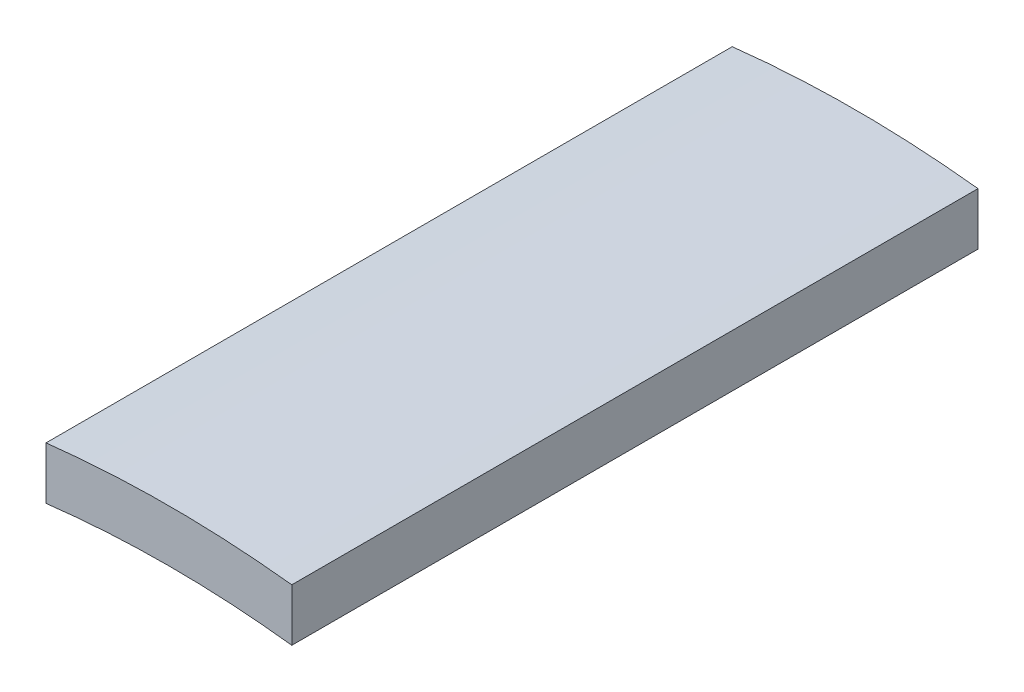
ISO-10303-21;
HEADER;
FILE_DESCRIPTION(('STEP AP214'),'2;1');
FILE_NAME('part.step','',(''),(''),'','','');
FILE_SCHEMA(('AUTOMOTIVE_DESIGN { 1 0 10303 214 1 1 1 1 }'));
ENDSEC;
DATA;
#1=APPLICATION_CONTEXT('core data for automotive mechanical design processes');
#2=APPLICATION_PROTOCOL_DEFINITION('international standard','automotive_design',2000,#1);
#3=PRODUCT_CONTEXT('',#1,'mechanical');
#4=PRODUCT('Part','Part','',(#3));
#5=PRODUCT_RELATED_PRODUCT_CATEGORY('part','',(#4));
#6=PRODUCT_DEFINITION_FORMATION('','',#4);
#7=PRODUCT_DEFINITION_CONTEXT('part definition',#1,'design');
#8=PRODUCT_DEFINITION('design','',#6,#7);
#9=PRODUCT_DEFINITION_SHAPE('','',#8);
#10=(LENGTH_UNIT() NAMED_UNIT(*) SI_UNIT(.MILLI.,.METRE.));
#11=(NAMED_UNIT(*) PLANE_ANGLE_UNIT() SI_UNIT($,.RADIAN.));
#12=(NAMED_UNIT(*) SI_UNIT($,.STERADIAN.) SOLID_ANGLE_UNIT());
#13=UNCERTAINTY_MEASURE_WITH_UNIT(LENGTH_MEASURE(1.E-05),#10,'distance_accuracy_value','');
#14=(GEOMETRIC_REPRESENTATION_CONTEXT(3) GLOBAL_UNCERTAINTY_ASSIGNED_CONTEXT((#13)) GLOBAL_UNIT_ASSIGNED_CONTEXT((#10,
#11,#12)) REPRESENTATION_CONTEXT('',''));
#15=CARTESIAN_POINT('',(0.,0.,0.));
#16=DIRECTION('',(0.,0.,1.));
#17=DIRECTION('',(1.,0.,0.));
#18=AXIS2_PLACEMENT_3D('',#15,#16,#17);
#19=CARTESIAN_POINT('',(-110.435261655171,-75.8999546142995,6.56206354763538));
#20=DIRECTION('',(0.,0.,1.));
#21=DIRECTION('',(1.,0.,0.));
#22=AXIS2_PLACEMENT_3D('',#19,#20,#21);
#23=CYLINDRICAL_SURFACE('',#22,2.50000000000002);
#24=DIRECTION('',(0.,0.,1.));
#25=VECTOR('',#24,1.);
#26=CARTESIAN_POINT('',(-110.152003047214,-73.4160535371593,9.26746205984027));
#27=LINE('',#26,#25);
#28=CARTESIAN_POINT('',(-110.152003047214,-73.4160535371593,9.26746205984027));
#29=VERTEX_POINT('',#28);
#30=CARTESIAN_POINT('',(-110.152003047214,-73.4160535371593,7.68593483208079));
#31=VERTEX_POINT('',#30);
#32=EDGE_CURVE('E58',#29,#31,#27,.F.);
#33=ORIENTED_EDGE('',*,*,#32,.T.);
#34=CARTESIAN_POINT('',(-110.435261655171,-75.8999546142995,7.68593483208079));
#35=DIRECTION('',(0.,0.,1.));
#36=DIRECTION('',(1.,0.,0.));
#37=AXIS2_PLACEMENT_3D('',#34,#35,#36);
#38=CIRCLE('',#37,2.50000000000002);
#39=CARTESIAN_POINT('',(-110.718520263128,-73.4160535371593,7.68593483208079));
#40=VERTEX_POINT('',#39);
#41=EDGE_CURVE('E67',#31,#40,#38,.T.);
#42=ORIENTED_EDGE('',*,*,#41,.T.);
#43=DIRECTION('',(0.,0.,-1.));
#44=VECTOR('',#43,1.);
#45=CARTESIAN_POINT('',(-110.718520263128,-73.4160535371594,7.68593483208079));
#46=LINE('',#45,#44);
#47=CARTESIAN_POINT('',(-110.718520263128,-73.4160535371593,9.26746205984027));
#48=VERTEX_POINT('',#47);
#49=EDGE_CURVE('E60',#40,#48,#46,.F.);
#50=ORIENTED_EDGE('',*,*,#49,.T.);
#51=CARTESIAN_POINT('',(-110.435261655171,-75.8999546142995,9.26746205984027));
#52=DIRECTION('',(0.,0.,1.));
#53=DIRECTION('',(1.,0.,0.));
#54=AXIS2_PLACEMENT_3D('',#51,#52,#53);
#55=CIRCLE('',#54,2.50000000000002);
#56=EDGE_CURVE('E20',#48,#29,#55,.F.);
#57=ORIENTED_EDGE('',*,*,#56,.T.);
#58=EDGE_LOOP('',(#33,#42,#50,#57));
#59=FACE_BOUND('',#58,.T.);
#60=ADVANCED_FACE('F17',(#59),#23,.T.);
#61=CARTESIAN_POINT('',(-110.152003047214,-76.3010935552146,9.26746205984027));
#62=DIRECTION('',(-1.,0.,0.));
#63=DIRECTION('',(0.,0.,1.));
#64=AXIS2_PLACEMENT_3D('',#61,#62,#63);
#65=PLANE('',#64);
#66=DIRECTION('',(0.,0.,1.));
#67=VECTOR('',#66,1.);
#68=CARTESIAN_POINT('',(-110.152003047214,-73.5368709168782,6.56206354763538));
#69=LINE('',#68,#67);
#70=CARTESIAN_POINT('',(-110.152003047214,-73.5368709168782,9.26746205984027));
#71=VERTEX_POINT('',#70);
#72=CARTESIAN_POINT('',(-110.152003047214,-73.5368709168782,7.68593483208079));
#73=VERTEX_POINT('',#72);
#74=EDGE_CURVE('E72',#71,#73,#69,.F.);
#75=ORIENTED_EDGE('',*,*,#74,.T.);
#76=DIRECTION('',(0.,1.,0.));
#77=VECTOR('',#76,1.);
#78=CARTESIAN_POINT('',(-110.152003047214,-76.3010935552146,7.68593483208079));
#79=LINE('',#78,#77);
#80=EDGE_CURVE('E66',#73,#31,#79,.T.);
#81=ORIENTED_EDGE('',*,*,#80,.T.);
#82=ORIENTED_EDGE('',*,*,#32,.F.);
#83=DIRECTION('',(0.,1.,0.));
#84=VECTOR('',#83,1.);
#85=CARTESIAN_POINT('',(-110.152003047214,-76.3010935552146,9.26746205984027));
#86=LINE('',#85,#84);
#87=EDGE_CURVE('E65',#29,#71,#86,.F.);
#88=ORIENTED_EDGE('',*,*,#87,.T.);
#89=EDGE_LOOP('',(#75,#81,#82,#88));
#90=FACE_BOUND('',#89,.T.);
#91=ADVANCED_FACE('F64',(#90),#65,.F.);
#92=CARTESIAN_POINT('',(-110.152003047214,-76.3010935552146,7.68593483208079));
#93=DIRECTION('',(0.,0.,1.));
#94=DIRECTION('',(1.,0.,0.));
#95=AXIS2_PLACEMENT_3D('',#92,#93,#94);
#96=PLANE('',#95);
#97=CARTESIAN_POINT('',(-110.435261655171,-75.8999546142995,7.68593483208079));
#98=DIRECTION('',(0.,0.,1.));
#99=DIRECTION('',(1.,0.,0.));
#100=AXIS2_PLACEMENT_3D('',#97,#98,#99);
#101=CIRCLE('',#100,2.38000000000001);
#102=CARTESIAN_POINT('',(-110.718520263128,-73.5368709168782,7.68593483208079));
#103=VERTEX_POINT('',#102);
#104=EDGE_CURVE('E79',#73,#103,#101,.T.);
#105=ORIENTED_EDGE('',*,*,#104,.T.);
#106=DIRECTION('',(0.,1.,0.));
#107=VECTOR('',#106,1.);
#108=CARTESIAN_POINT('',(-110.718520263128,-76.3010935552146,7.68593483208079));
#109=LINE('',#108,#107);
#110=EDGE_CURVE('E70',#103,#40,#109,.T.);
#111=ORIENTED_EDGE('',*,*,#110,.T.);
#112=ORIENTED_EDGE('',*,*,#41,.F.);
#113=ORIENTED_EDGE('',*,*,#80,.F.);
#114=EDGE_LOOP('',(#105,#111,#112,#113));
#115=FACE_BOUND('',#114,.T.);
#116=ADVANCED_FACE('F85',(#115),#96,.F.);
#117=CARTESIAN_POINT('',(-110.718520263128,-76.3010935552146,7.68593483208079));
#118=DIRECTION('',(1.,0.,0.));
#119=DIRECTION('',(0.,0.,-1.));
#120=AXIS2_PLACEMENT_3D('',#117,#118,#119);
#121=PLANE('',#120);
#122=DIRECTION('',(0.,0.,1.));
#123=VECTOR('',#122,1.);
#124=CARTESIAN_POINT('',(-110.718520263128,-73.5368709168782,6.56206354763538));
#125=LINE('',#124,#123);
#126=CARTESIAN_POINT('',(-110.718520263128,-73.5368709168782,9.26746205984027));
#127=VERTEX_POINT('',#126);
#128=EDGE_CURVE('E26',#103,#127,#125,.T.);
#129=ORIENTED_EDGE('',*,*,#128,.T.);
#130=DIRECTION('',(0.,1.,0.));
#131=VECTOR('',#130,1.);
#132=CARTESIAN_POINT('',(-110.718520263128,-76.3010935552146,9.26746205984027));
#133=LINE('',#132,#131);
#134=EDGE_CURVE('E34',#127,#48,#133,.T.);
#135=ORIENTED_EDGE('',*,*,#134,.T.);
#136=ORIENTED_EDGE('',*,*,#49,.F.);
#137=ORIENTED_EDGE('',*,*,#110,.F.);
#138=EDGE_LOOP('',(#129,#135,#136,#137));
#139=FACE_BOUND('',#138,.T.);
#140=ADVANCED_FACE('F89',(#139),#121,.F.);
#141=CARTESIAN_POINT('',(-110.718520263128,-76.3010935552146,9.26746205984027));
#142=DIRECTION('',(0.,0.,-1.));
#143=DIRECTION('',(-1.,0.,0.));
#144=AXIS2_PLACEMENT_3D('',#141,#142,#143);
#145=PLANE('',#144);
#146=CARTESIAN_POINT('',(-110.435261655171,-75.8999546142995,9.26746205984027));
#147=DIRECTION('',(0.,0.,1.));
#148=DIRECTION('',(1.,0.,0.));
#149=AXIS2_PLACEMENT_3D('',#146,#147,#148);
#150=CIRCLE('',#149,2.38000000000001);
#151=EDGE_CURVE('E11',#127,#71,#150,.F.);
#152=ORIENTED_EDGE('',*,*,#151,.T.);
#153=ORIENTED_EDGE('',*,*,#87,.F.);
#154=ORIENTED_EDGE('',*,*,#56,.F.);
#155=ORIENTED_EDGE('',*,*,#134,.F.);
#156=EDGE_LOOP('',(#152,#153,#154,#155));
#157=FACE_BOUND('',#156,.T.);
#158=ADVANCED_FACE('F69',(#157),#145,.F.);
#159=CARTESIAN_POINT('',(-110.435261655171,-75.8999546142995,6.56206354763538));
#160=DIRECTION('',(0.,0.,1.));
#161=DIRECTION('',(1.,0.,0.));
#162=AXIS2_PLACEMENT_3D('',#159,#160,#161);
#163=CYLINDRICAL_SURFACE('',#162,2.38000000000001);
#164=ORIENTED_EDGE('',*,*,#128,.F.);
#165=ORIENTED_EDGE('',*,*,#104,.F.);
#166=ORIENTED_EDGE('',*,*,#74,.F.);
#167=ORIENTED_EDGE('',*,*,#151,.F.);
#168=EDGE_LOOP('',(#164,#165,#166,#167));
#169=FACE_BOUND('',#168,.T.);
#170=ADVANCED_FACE('F91',(#169),#163,.F.);
#171=CLOSED_SHELL('',(#60,#91,#116,#140,#158,#170));
#172=MANIFOLD_SOLID_BREP('B1',#171);
#173=ADVANCED_BREP_SHAPE_REPRESENTATION('',(#18,#172),#14);
#174=SHAPE_DEFINITION_REPRESENTATION(#9,#173);
ENDSEC;
END-ISO-10303-21;
